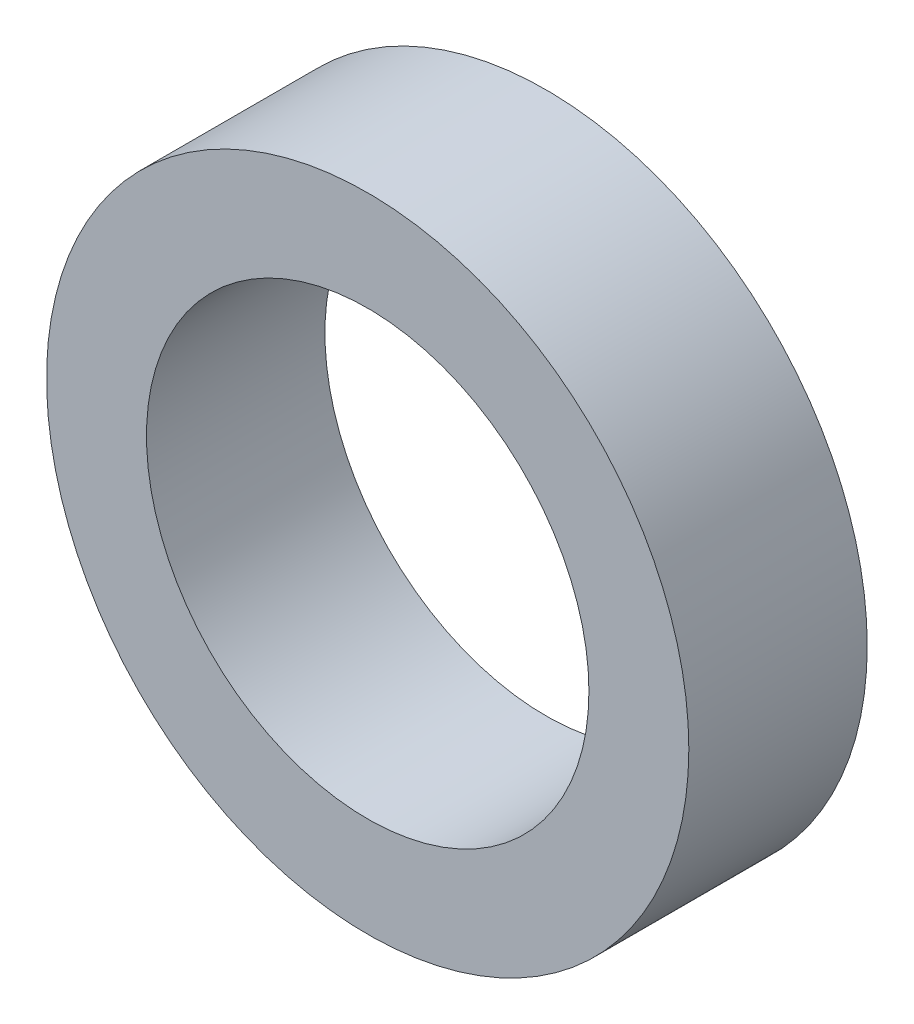
ISO-10303-21;
HEADER;
FILE_DESCRIPTION(('STEP AP214'),'2;1');
FILE_NAME('part.step','',(''),(''),'','','');
FILE_SCHEMA(('AUTOMOTIVE_DESIGN { 1 0 10303 214 1 1 1 1 }'));
ENDSEC;
DATA;
#1=APPLICATION_CONTEXT('core data for automotive mechanical design processes');
#2=APPLICATION_PROTOCOL_DEFINITION('international standard','automotive_design',2000,#1);
#3=PRODUCT_CONTEXT('',#1,'mechanical');
#4=PRODUCT('Part','Part','',(#3));
#5=PRODUCT_RELATED_PRODUCT_CATEGORY('part','',(#4));
#6=PRODUCT_DEFINITION_FORMATION('','',#4);
#7=PRODUCT_DEFINITION_CONTEXT('part definition',#1,'design');
#8=PRODUCT_DEFINITION('design','',#6,#7);
#9=PRODUCT_DEFINITION_SHAPE('','',#8);
#10=(LENGTH_UNIT() NAMED_UNIT(*) SI_UNIT(.MILLI.,.METRE.));
#11=(NAMED_UNIT(*) PLANE_ANGLE_UNIT() SI_UNIT($,.RADIAN.));
#12=(NAMED_UNIT(*) SI_UNIT($,.STERADIAN.) SOLID_ANGLE_UNIT());
#13=UNCERTAINTY_MEASURE_WITH_UNIT(LENGTH_MEASURE(1.E-05),#10,'distance_accuracy_value','');
#14=(GEOMETRIC_REPRESENTATION_CONTEXT(3) GLOBAL_UNCERTAINTY_ASSIGNED_CONTEXT((#13)) GLOBAL_UNIT_ASSIGNED_CONTEXT((#10,
#11,#12)) REPRESENTATION_CONTEXT('',''));
#15=CARTESIAN_POINT('',(0.,0.,0.));
#16=DIRECTION('',(0.,0.,1.));
#17=DIRECTION('',(1.,0.,0.));
#18=AXIS2_PLACEMENT_3D('',#15,#16,#17);
#19=CARTESIAN_POINT('',(0.,0.,5.));
#20=DIRECTION('',(0.,0.,1.));
#21=DIRECTION('',(1.,0.,0.));
#22=AXIS2_PLACEMENT_3D('',#19,#20,#21);
#23=PLANE('',#22);
#24=CARTESIAN_POINT('',(0.,0.,5.));
#25=DIRECTION('',(0.,0.,1.));
#26=DIRECTION('',(1.,0.,0.));
#27=AXIS2_PLACEMENT_3D('',#24,#25,#26);
#28=CIRCLE('',#27,9.);
#29=CARTESIAN_POINT('',(9.,0.,5.));
#30=VERTEX_POINT('',#29);
#31=EDGE_CURVE('E10',#30,#30,#28,.T.);
#32=ORIENTED_EDGE('',*,*,#31,.T.);
#33=EDGE_LOOP('',(#32));
#34=FACE_BOUND('',#33,.T.);
#35=CARTESIAN_POINT('',(0.,0.,5.));
#36=DIRECTION('',(0.,0.,1.));
#37=DIRECTION('',(1.,0.,0.));
#38=AXIS2_PLACEMENT_3D('',#35,#36,#37);
#39=CIRCLE('',#38,6.2);
#40=CARTESIAN_POINT('',(6.2,0.,5.));
#41=VERTEX_POINT('',#40);
#42=EDGE_CURVE('E52',#41,#41,#39,.T.);
#43=ORIENTED_EDGE('',*,*,#42,.F.);
#44=EDGE_LOOP('',(#43));
#45=FACE_BOUND('',#44,.T.);
#46=ADVANCED_FACE('F39',(#34,#45),#23,.T.);
#47=CARTESIAN_POINT('',(0.,0.,0.));
#48=DIRECTION('',(0.,0.,1.));
#49=DIRECTION('',(1.,0.,0.));
#50=AXIS2_PLACEMENT_3D('',#47,#48,#49);
#51=PLANE('',#50);
#52=CARTESIAN_POINT('',(0.,0.,0.));
#53=DIRECTION('',(0.,0.,1.));
#54=DIRECTION('',(1.,0.,0.));
#55=AXIS2_PLACEMENT_3D('',#52,#53,#54);
#56=CIRCLE('',#55,9.);
#57=CARTESIAN_POINT('',(9.,0.,0.));
#58=VERTEX_POINT('',#57);
#59=EDGE_CURVE('E43',#58,#58,#56,.T.);
#60=ORIENTED_EDGE('',*,*,#59,.F.);
#61=EDGE_LOOP('',(#60));
#62=FACE_BOUND('',#61,.T.);
#63=CARTESIAN_POINT('',(0.,0.,0.));
#64=DIRECTION('',(0.,0.,1.));
#65=DIRECTION('',(1.,0.,0.));
#66=AXIS2_PLACEMENT_3D('',#63,#64,#65);
#67=CIRCLE('',#66,6.2);
#68=CARTESIAN_POINT('',(6.2,0.,0.));
#69=VERTEX_POINT('',#68);
#70=EDGE_CURVE('E54',#69,#69,#67,.T.);
#71=ORIENTED_EDGE('',*,*,#70,.T.);
#72=EDGE_LOOP('',(#71));
#73=FACE_BOUND('',#72,.T.);
#74=ADVANCED_FACE('F66',(#62,#73),#51,.F.);
#75=CARTESIAN_POINT('',(0.,0.,5.));
#76=DIRECTION('',(0.,0.,-1.));
#77=DIRECTION('',(-1.,0.,0.));
#78=AXIS2_PLACEMENT_3D('',#75,#76,#77);
#79=CYLINDRICAL_SURFACE('',#78,9.);
#80=ORIENTED_EDGE('',*,*,#31,.F.);
#81=EDGE_LOOP('',(#80));
#82=FACE_BOUND('',#81,.T.);
#83=ORIENTED_EDGE('',*,*,#59,.T.);
#84=EDGE_LOOP('',(#83));
#85=FACE_BOUND('',#84,.T.);
#86=ADVANCED_FACE('F41',(#82,#85),#79,.T.);
#87=CARTESIAN_POINT('',(0.,0.,5.));
#88=DIRECTION('',(0.,0.,-1.));
#89=DIRECTION('',(-1.,0.,0.));
#90=AXIS2_PLACEMENT_3D('',#87,#88,#89);
#91=CYLINDRICAL_SURFACE('',#90,6.2);
#92=ORIENTED_EDGE('',*,*,#42,.T.);
#93=EDGE_LOOP('',(#92));
#94=FACE_BOUND('',#93,.T.);
#95=ORIENTED_EDGE('',*,*,#70,.F.);
#96=EDGE_LOOP('',(#95));
#97=FACE_BOUND('',#96,.T.);
#98=ADVANCED_FACE('F62',(#94,#97),#91,.F.);
#99=CLOSED_SHELL('',(#46,#74,#86,#98));
#100=MANIFOLD_SOLID_BREP('B2',#99);
#101=ADVANCED_BREP_SHAPE_REPRESENTATION('',(#18,#100),#14);
#102=SHAPE_DEFINITION_REPRESENTATION(#9,#101);
ENDSEC;
END-ISO-10303-21;
